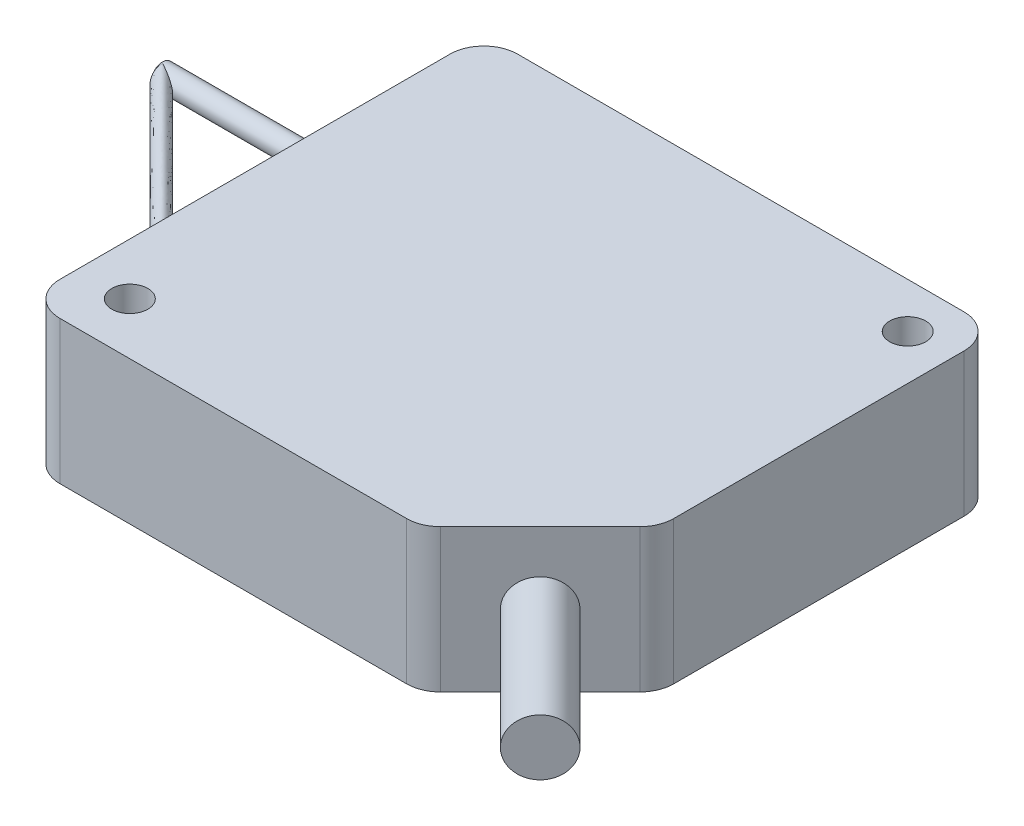
ISO-10303-21;
HEADER;
FILE_DESCRIPTION(('STEP AP214'),'2;1');
FILE_NAME('part.step','',(''),(''),'','','');
FILE_SCHEMA(('AUTOMOTIVE_DESIGN { 1 0 10303 214 1 1 1 1 }'));
ENDSEC;
DATA;
#1=APPLICATION_CONTEXT('core data for automotive mechanical design processes');
#2=APPLICATION_PROTOCOL_DEFINITION('international standard','automotive_design',2000,#1);
#3=PRODUCT_CONTEXT('',#1,'mechanical');
#4=PRODUCT('Part','Part','',(#3));
#5=PRODUCT_RELATED_PRODUCT_CATEGORY('part','',(#4));
#6=PRODUCT_DEFINITION_FORMATION('','',#4);
#7=PRODUCT_DEFINITION_CONTEXT('part definition',#1,'design');
#8=PRODUCT_DEFINITION('design','',#6,#7);
#9=PRODUCT_DEFINITION_SHAPE('','',#8);
#10=(LENGTH_UNIT() NAMED_UNIT(*) SI_UNIT(.MILLI.,.METRE.));
#11=(NAMED_UNIT(*) PLANE_ANGLE_UNIT() SI_UNIT($,.RADIAN.));
#12=(NAMED_UNIT(*) SI_UNIT($,.STERADIAN.) SOLID_ANGLE_UNIT());
#13=UNCERTAINTY_MEASURE_WITH_UNIT(LENGTH_MEASURE(1.E-05),#10,'distance_accuracy_value','');
#14=(GEOMETRIC_REPRESENTATION_CONTEXT(3) GLOBAL_UNCERTAINTY_ASSIGNED_CONTEXT((#13)) GLOBAL_UNIT_ASSIGNED_CONTEXT((#10,
#11,#12)) REPRESENTATION_CONTEXT('',''));
#15=CARTESIAN_POINT('',(0.,0.,0.));
#16=DIRECTION('',(0.,0.,1.));
#17=DIRECTION('',(1.,0.,0.));
#18=AXIS2_PLACEMENT_3D('',#15,#16,#17);
#19=CARTESIAN_POINT('',(1.,2.,-6.));
#20=DIRECTION('',(1.,0.,0.));
#21=DIRECTION('',(0.,0.,-1.));
#22=AXIS2_PLACEMENT_3D('',#19,#20,#21);
#23=PLANE('',#22);
#24=CARTESIAN_POINT('',(1.,6.35,-29.6));
#25=DIRECTION('',(1.,0.,0.));
#26=DIRECTION('',(0.,0.,-1.));
#27=AXIS2_PLACEMENT_3D('',#24,#25,#26);
#28=CIRCLE('',#27,1.);
#29=CARTESIAN_POINT('',(1.,6.35,-30.6));
#30=VERTEX_POINT('',#29);
#31=EDGE_CURVE('E166',#30,#30,#28,.F.);
#32=ORIENTED_EDGE('',*,*,#31,.F.);
#33=EDGE_LOOP('',(#32));
#34=FACE_BOUND('',#33,.T.);
#35=DIRECTION('',(0.,0.,1.));
#36=VECTOR('',#35,1.);
#37=CARTESIAN_POINT('',(1.,2.,-34.6));
#38=LINE('',#37,#36);
#39=CARTESIAN_POINT('',(1.,2.,-32.6));
#40=VERTEX_POINT('',#39);
#41=CARTESIAN_POINT('',(1.,2.,-8.00000000000001));
#42=VERTEX_POINT('',#41);
#43=EDGE_CURVE('E195',#40,#42,#38,.T.);
#44=ORIENTED_EDGE('',*,*,#43,.T.);
#45=CARTESIAN_POINT('',(1.,4.,-8.));
#46=DIRECTION('',(1.,0.,0.));
#47=DIRECTION('',(0.,0.,-1.));
#48=AXIS2_PLACEMENT_3D('',#45,#46,#47);
#49=CIRCLE('',#48,2.);
#50=CARTESIAN_POINT('',(1.,4.,-6.));
#51=VERTEX_POINT('',#50);
#52=EDGE_CURVE('E274',#42,#51,#49,.F.);
#53=ORIENTED_EDGE('',*,*,#52,.T.);
#54=DIRECTION('',(0.,1.,0.));
#55=VECTOR('',#54,1.);
#56=CARTESIAN_POINT('',(1.,10.7,-6.));
#57=LINE('',#56,#55);
#58=CARTESIAN_POINT('',(1.,8.7,-6.));
#59=VERTEX_POINT('',#58);
#60=EDGE_CURVE('E198',#51,#59,#57,.T.);
#61=ORIENTED_EDGE('',*,*,#60,.T.);
#62=CARTESIAN_POINT('',(1.,8.7,-8.));
#63=DIRECTION('',(1.,0.,0.));
#64=DIRECTION('',(0.,0.,-1.));
#65=AXIS2_PLACEMENT_3D('',#62,#63,#64);
#66=CIRCLE('',#65,2.);
#67=CARTESIAN_POINT('',(1.,10.7,-8.00000000000001));
#68=VERTEX_POINT('',#67);
#69=EDGE_CURVE('E272',#59,#68,#66,.F.);
#70=ORIENTED_EDGE('',*,*,#69,.T.);
#71=DIRECTION('',(0.,0.,-1.));
#72=VECTOR('',#71,1.);
#73=CARTESIAN_POINT('',(1.,10.7,-34.6));
#74=LINE('',#73,#72);
#75=CARTESIAN_POINT('',(1.,10.7,-32.6));
#76=VERTEX_POINT('',#75);
#77=EDGE_CURVE('E202',#68,#76,#74,.T.);
#78=ORIENTED_EDGE('',*,*,#77,.T.);
#79=CARTESIAN_POINT('',(1.,8.7,-32.6));
#80=DIRECTION('',(1.,0.,0.));
#81=DIRECTION('',(0.,0.,-1.));
#82=AXIS2_PLACEMENT_3D('',#79,#80,#81);
#83=CIRCLE('',#82,2.);
#84=CARTESIAN_POINT('',(1.,8.7,-34.6));
#85=VERTEX_POINT('',#84);
#86=EDGE_CURVE('E268',#76,#85,#83,.F.);
#87=ORIENTED_EDGE('',*,*,#86,.T.);
#88=DIRECTION('',(0.,-1.,0.));
#89=VECTOR('',#88,1.);
#90=CARTESIAN_POINT('',(1.,10.7,-34.6));
#91=LINE('',#90,#89);
#92=CARTESIAN_POINT('',(1.,4.,-34.6));
#93=VERTEX_POINT('',#92);
#94=EDGE_CURVE('E205',#85,#93,#91,.T.);
#95=ORIENTED_EDGE('',*,*,#94,.T.);
#96=CARTESIAN_POINT('',(1.,4.,-32.6));
#97=DIRECTION('',(1.,0.,0.));
#98=DIRECTION('',(0.,0.,-1.));
#99=AXIS2_PLACEMENT_3D('',#96,#97,#98);
#100=CIRCLE('',#99,2.);
#101=EDGE_CURVE('E270',#93,#40,#100,.F.);
#102=ORIENTED_EDGE('',*,*,#101,.T.);
#103=EDGE_LOOP('',(#44,#53,#61,#70,#78,#87,#95,#102));
#104=FACE_BOUND('',#103,.T.);
#105=CARTESIAN_POINT('',(0.999999999999997,6.35,-11.));
#106=DIRECTION('',(-1.,0.,0.));
#107=DIRECTION('',(0.,0.,1.));
#108=AXIS2_PLACEMENT_3D('',#105,#106,#107);
#109=CIRCLE('',#108,1.);
#110=CARTESIAN_POINT('',(0.999999999999997,6.35,-10.));
#111=VERTEX_POINT('',#110);
#112=EDGE_CURVE('E11',#111,#111,#109,.T.);
#113=ORIENTED_EDGE('',*,*,#112,.F.);
#114=EDGE_LOOP('',(#113));
#115=FACE_BOUND('',#114,.T.);
#116=ADVANCED_FACE('F31',(#34,#104,#115),#23,.F.);
#117=CARTESIAN_POINT('',(-17.5,6.35,-29.6));
#118=DIRECTION('',(1.,0.,0.));
#119=DIRECTION('',(0.,0.,-1.));
#120=AXIS2_PLACEMENT_3D('',#117,#118,#119);
#121=CYLINDRICAL_SURFACE('',#120,1.);
#122=ORIENTED_EDGE('',*,*,#31,.T.);
#123=EDGE_LOOP('',(#122));
#124=FACE_BOUND('',#123,.T.);
#125=CARTESIAN_POINT('',(-17.5,6.35,-29.6));
#126=DIRECTION('',(-1.,0.,0.));
#127=DIRECTION('',(0.,0.,1.));
#128=AXIS2_PLACEMENT_3D('',#125,#126,#127);
#129=CIRCLE('',#128,1.);
#130=CARTESIAN_POINT('',(-17.5,6.35,-28.6));
#131=VERTEX_POINT('',#130);
#132=EDGE_CURVE('E170',#131,#131,#129,.T.);
#133=ORIENTED_EDGE('',*,*,#132,.F.);
#134=EDGE_LOOP('',(#133));
#135=FACE_BOUND('',#134,.T.);
#136=CARTESIAN_POINT('',(-17.3847763108503,5.35580701525952,-29.4923881554251));
#137=CARTESIAN_POINT('',(-17.310243625098,5.35986745791576,-29.4551218125515));
#138=CARTESIAN_POINT('',(-17.2357842856062,5.36599286304666,-29.4178921428041));
#139=CARTESIAN_POINT('',(-17.0871803121188,5.38267367968977,-29.3435901560583));
#140=CARTESIAN_POINT('',(-17.0130361343693,5.39323413995916,-29.3065180671828));
#141=CARTESIAN_POINT('',(-16.8653793529942,5.41908114270014,-29.2326896765034));
#142=CARTESIAN_POINT('',(-16.7918669483466,5.43436912181265,-29.1959334741885));
#143=CARTESIAN_POINT('',(-16.6458701853368,5.47019015357799,-29.1229350926532));
#144=CARTESIAN_POINT('',(-16.5733855542558,5.49072178625981,-29.0866927770735));
#145=CARTESIAN_POINT('',(-16.4551950691772,5.5295567658836,-29.0275975346238));
#146=CARTESIAN_POINT('',(-16.4090276997573,5.54610885492395,-29.0045138499885));
#147=CARTESIAN_POINT('',(-16.3175983635991,5.58207520713222,-28.9587991819042));
#148=CARTESIAN_POINT('',(-16.2723361196687,5.6014885783099,-28.9361680598591));
#149=CARTESIAN_POINT('',(-16.1941901970999,5.63834384285589,-28.8970950985313));
#150=CARTESIAN_POINT('',(-16.1610370480583,5.65506807802909,-28.8805185240228));
#151=CARTESIAN_POINT('',(-16.0955845028499,5.6906310600694,-28.8477922514312));
#152=CARTESIAN_POINT('',(-16.0632866524229,5.70947335018052,-28.831643326218));
#153=CARTESIAN_POINT('',(-15.9820058290998,5.76082370450563,-28.7910029145396));
#154=CARTESIAN_POINT('',(-15.933857032719,5.79505682710886,-28.7669285163223));
#155=CARTESIAN_POINT('',(-15.8652814683382,5.85183402254099,-28.7326407341876));
#156=CARTESIAN_POINT('',(-15.843052494921,5.87164051106554,-28.7215262475134));
#157=CARTESIAN_POINT('',(-15.8001827970631,5.91328779090199,-28.7000913985845));
#158=CARTESIAN_POINT('',(-15.7795435527532,5.93513043716419,-28.689771776395));
#159=CARTESIAN_POINT('',(-15.7182633068036,6.00709548994654,-28.6591316533626));
#160=CARTESIAN_POINT('',(-15.6811185184997,6.06148526774109,-28.6405592592434));
#161=CARTESIAN_POINT('',(-15.6413197710703,6.14616497512418,-28.6206598855378));
#162=CARTESIAN_POINT('',(-15.6311715206006,6.17206893131412,-28.6155857603011));
#163=CARTESIAN_POINT('',(-15.6148515753546,6.22541385293124,-28.6074257876765));
#164=CARTESIAN_POINT('',(-15.6086755260327,6.25285309928183,-28.6043377630158));
#165=CARTESIAN_POINT('',(-15.6009132546554,6.30874678210803,-28.6004566273282));
#166=CARTESIAN_POINT('',(-15.5993591153064,6.33720693317751,-28.5996795576543));
#167=CARTESIAN_POINT('',(-15.6011258833518,6.39393690287961,-28.6005629416747));
#168=CARTESIAN_POINT('',(-15.6044472105158,6.42220670491296,-28.6022236052536));
#169=CARTESIAN_POINT('',(-15.6149804837681,6.47469146088525,-28.6074902418878));
#170=CARTESIAN_POINT('',(-15.6217497821927,6.49902151061303,-28.6108748911098));
#171=CARTESIAN_POINT('',(-15.6383446123074,6.54635648354788,-28.6191723061676));
#172=CARTESIAN_POINT('',(-15.6481746853839,6.56935937709176,-28.6240873426965));
#173=CARTESIAN_POINT('',(-15.6771978614054,6.62765132246839,-28.6385989306953));
#174=CARTESIAN_POINT('',(-15.6984108274498,6.66167810955879,-28.6492054137229));
#175=CARTESIAN_POINT('',(-15.745245229897,6.72568648050616,-28.6726226149504));
#176=CARTESIAN_POINT('',(-15.7708784373862,6.75565687174442,-28.6854392186935));
#177=CARTESIAN_POINT('',(-15.821867216591,6.80860208538243,-28.7109336082951));
#178=CARTESIAN_POINT('',(-15.8468899979777,6.83198489588555,-28.7234449989891));
#179=CARTESIAN_POINT('',(-15.8985730867418,6.87625301124813,-28.7492865433706));
#180=CARTESIAN_POINT('',(-15.9252312018803,6.89714155363213,-28.7626156009386));
#181=CARTESIAN_POINT('',(-15.9954010142126,6.94812216011064,-28.7977005071085));
#182=CARTESIAN_POINT('',(-16.0398256769645,6.97663867014264,-28.8199128384932));
#183=CARTESIAN_POINT('',(-16.1307031349753,7.02933838757336,-28.8653515674766));
#184=CARTESIAN_POINT('',(-16.1771581392555,7.05351672131496,-28.8885790695858));
#185=CARTESIAN_POINT('',(-16.271276731196,7.09811076358632,-28.9356383656397));
#186=CARTESIAN_POINT('',(-16.31893523691,7.11854000327428,-28.9594676186107));
#187=CARTESIAN_POINT('',(-16.4152436264059,7.15623983273529,-29.007621813359));
#188=CARTESIAN_POINT('',(-16.4638937428288,7.17350967157932,-29.0319468714567));
#189=CARTESIAN_POINT('',(-16.5618518026218,7.20522627957335,-29.0809259012685));
#190=CARTESIAN_POINT('',(-16.6111588125432,7.21967667554942,-29.1055794062581));
#191=CARTESIAN_POINT('',(-16.7103220254289,7.24605021126928,-29.1551610127279));
#192=CARTESIAN_POINT('',(-16.7601784156319,7.25797245947007,-29.1800892078276));
#193=CARTESIAN_POINT('',(-16.9050275061144,7.28910635161141,-29.252513753035));
#194=CARTESIAN_POINT('',(-17.0005489251864,7.30531363833591,-29.3002744625133));
#195=CARTESIAN_POINT('',(-17.1443440968937,7.32401453553611,-29.3721720484867));
#196=CARTESIAN_POINT('',(-17.1923498513107,7.32931256898411,-29.3961749257694));
#197=CARTESIAN_POINT('',(-17.2884813840548,7.33809665960482,-29.4442406921958));
#198=CARTESIAN_POINT('',(-17.3366071274664,7.3415831933199,-29.4683035638817));
#199=CARTESIAN_POINT('',(-17.3847763108501,7.34419298474035,-29.4923881554254));
#200=B_SPLINE_CURVE_WITH_KNOTS('',3,(#136,#137,#138,#139,#140,#141,#142,#143,#144,#145,#146,
#147,#148,#149,#150,#151,#152,#153,#154,#155,#156,#157,#158,#159,#160,#161,#162,#163,#164,#165,
#166,#167,#168,#169,#170,#171,#172,#173,#174,#175,#176,#177,#178,#179,#180,#181,#182,#183,#184,
#185,#186,#187,#188,#189,#190,#191,#192,#193,#194,#195,#196,#197,#198,#199),.UNSPECIFIED.,.F.,
.F.,(4,2,2,2,2,2,2,2,2,2,2,2,2,2,2,2,2,2,2,2,2,2,2,2,2,2,2,2,2,2,2,4),(0.,0.250289149542454,
0.500863997711973,0.751515067774774,1.00209833386037,1.1646473598658,1.32714581879982,
1.44907870737169,1.57121869858094,1.76206440002198,1.85728585417112,1.95259491949081,
2.15468033805398,2.2392089546906,2.32364474774139,2.40866529434888,2.49369316151331,
2.56983917256255,2.64609870706466,2.76981409647456,2.89386417606205,3.0030919851586,
3.11217644042589,3.28369854706395,3.45541215723075,3.62649328024101,3.79761501327529,
3.96851514903835,4.13947545231302,4.46318144145814,4.62495751389052,4.7866910071089),.UNSPECIFIED.);
#201=CARTESIAN_POINT('',(-17.3847763108503,5.35580701525952,-29.4923881554251));
#202=VERTEX_POINT('',#201);
#203=CARTESIAN_POINT('',(-17.3847763108503,7.34419298474048,-29.4923881554251));
#204=VERTEX_POINT('',#203);
#205=EDGE_CURVE('E39',#202,#204,#200,.T.);
#206=ORIENTED_EDGE('',*,*,#205,.F.);
#207=CARTESIAN_POINT('',(-17.3847763108503,6.35,-29.6));
#208=DIRECTION('',(-1.,0.,0.));
#209=DIRECTION('',(0.,0.,1.));
#210=AXIS2_PLACEMENT_3D('',#207,#208,#209);
#211=CIRCLE('',#210,1.);
#212=EDGE_CURVE('E162',#202,#204,#211,.T.);
#213=ORIENTED_EDGE('',*,*,#212,.T.);
#214=EDGE_LOOP('',(#206,#213));
#215=FACE_BOUND('',#214,.T.);
#216=ADVANCED_FACE('F172',(#124,#135,#215),#121,.T.);
#217=CARTESIAN_POINT('',(45.6,12.7,-10.6));
#218=DIRECTION('',(-0.707106781186549,0.,-0.707106781186546));
#219=DIRECTION('',(-0.707106781186546,0.,0.707106781186549));
#220=AXIS2_PLACEMENT_3D('',#217,#218,#219);
#221=PLANE('',#220);
#222=DIRECTION('',(0.707106781186546,0.,-0.707106781186549));
#223=VECTOR('',#222,1.);
#224=CARTESIAN_POINT('',(45.6,12.7,-10.6));
#225=LINE('',#224,#223);
#226=CARTESIAN_POINT('',(35.8786796564404,12.7,-0.878679656440359));
#227=VERTEX_POINT('',#226);
#228=CARTESIAN_POINT('',(44.7213203435596,12.7,-9.72132034355968));
#229=VERTEX_POINT('',#228);
#230=EDGE_CURVE('E234',#227,#229,#225,.T.);
#231=ORIENTED_EDGE('',*,*,#230,.F.);
#232=DIRECTION('',(0.,-1.,0.));
#233=VECTOR('',#232,1.);
#234=CARTESIAN_POINT('',(35.8786796564404,12.7,-0.878679656440359));
#235=LINE('',#234,#233);
#236=CARTESIAN_POINT('',(35.8786796564404,0.,-0.878679656440359));
#237=VERTEX_POINT('',#236);
#238=EDGE_CURVE('E299',#227,#237,#235,.T.);
#239=ORIENTED_EDGE('',*,*,#238,.T.);
#240=DIRECTION('',(0.707106781186546,0.,-0.707106781186549));
#241=VECTOR('',#240,1.);
#242=CARTESIAN_POINT('',(45.6,0.,-10.6));
#243=LINE('',#242,#241);
#244=CARTESIAN_POINT('',(44.7213203435596,0.,-9.72132034355968));
#245=VERTEX_POINT('',#244);
#246=EDGE_CURVE('E249',#237,#245,#243,.T.);
#247=ORIENTED_EDGE('',*,*,#246,.T.);
#248=DIRECTION('',(0.,-1.,0.));
#249=VECTOR('',#248,1.);
#250=CARTESIAN_POINT('',(44.7213203435596,12.7,-9.72132034355968));
#251=LINE('',#250,#249);
#252=EDGE_CURVE('E297',#245,#229,#251,.F.);
#253=ORIENTED_EDGE('',*,*,#252,.T.);
#254=EDGE_LOOP('',(#231,#239,#247,#253));
#255=FACE_BOUND('',#254,.T.);
#256=CARTESIAN_POINT('',(40.3,6.35,-5.30000000000001));
#257=DIRECTION('',(-0.707106781186549,0.,-0.707106781186546));
#258=DIRECTION('',(-0.707106781186546,0.,0.707106781186549));
#259=AXIS2_PLACEMENT_3D('',#256,#257,#258);
#260=CIRCLE('',#259,2.5);
#261=CARTESIAN_POINT('',(38.5322330470336,6.35,-3.53223304703364));
#262=VERTEX_POINT('',#261);
#263=EDGE_CURVE('E294',#262,#262,#260,.F.);
#264=ORIENTED_EDGE('',*,*,#263,.F.);
#265=EDGE_LOOP('',(#264));
#266=FACE_BOUND('',#265,.T.);
#267=ADVANCED_FACE('F409',(#255,#266),#221,.F.);
#268=CARTESIAN_POINT('',(0.,12.7,0.));
#269=DIRECTION('',(0.,-1.,0.));
#270=DIRECTION('',(0.,0.,-1.));
#271=AXIS2_PLACEMENT_3D('',#268,#269,#270);
#272=PLANE('',#271);
#273=CARTESIAN_POINT('',(41.6,12.7,-36.6));
#274=DIRECTION('',(0.,1.,0.));
#275=DIRECTION('',(0.,0.,1.));
#276=AXIS2_PLACEMENT_3D('',#273,#274,#275);
#277=CIRCLE('',#276,1.6);
#278=CARTESIAN_POINT('',(41.6,12.7,-35.));
#279=VERTEX_POINT('',#278);
#280=EDGE_CURVE('E225',#279,#279,#277,.T.);
#281=ORIENTED_EDGE('',*,*,#280,.F.);
#282=EDGE_LOOP('',(#281));
#283=FACE_BOUND('',#282,.T.);
#284=DIRECTION('',(1.,0.,0.));
#285=VECTOR('',#284,1.);
#286=CARTESIAN_POINT('',(35.,12.7,0.));
#287=LINE('',#286,#285);
#288=CARTESIAN_POINT('',(3.,12.7,0.));
#289=VERTEX_POINT('',#288);
#290=CARTESIAN_POINT('',(33.7573593128807,12.7,0.));
#291=VERTEX_POINT('',#290);
#292=EDGE_CURVE('E231',#289,#291,#287,.T.);
#293=ORIENTED_EDGE('',*,*,#292,.T.);
#294=CARTESIAN_POINT('',(33.7573593128807,12.7,-3.));
#295=DIRECTION('',(0.,-1.,0.));
#296=DIRECTION('',(0.,0.,-1.));
#297=AXIS2_PLACEMENT_3D('',#294,#295,#296);
#298=CIRCLE('',#297,3.);
#299=EDGE_CURVE('E325',#291,#227,#298,.F.);
#300=ORIENTED_EDGE('',*,*,#299,.T.);
#301=ORIENTED_EDGE('',*,*,#230,.T.);
#302=CARTESIAN_POINT('',(42.6,12.7,-11.8426406871193));
#303=DIRECTION('',(0.,-1.,0.));
#304=DIRECTION('',(0.,0.,-1.));
#305=AXIS2_PLACEMENT_3D('',#302,#303,#304);
#306=CIRCLE('',#305,3.);
#307=CARTESIAN_POINT('',(45.6,12.7,-11.8426406871193));
#308=VERTEX_POINT('',#307);
#309=EDGE_CURVE('E323',#229,#308,#306,.F.);
#310=ORIENTED_EDGE('',*,*,#309,.T.);
#311=DIRECTION('',(0.,0.,-1.));
#312=VECTOR('',#311,1.);
#313=CARTESIAN_POINT('',(45.6,12.7,-40.6));
#314=LINE('',#313,#312);
#315=CARTESIAN_POINT('',(45.6,12.7,-37.6));
#316=VERTEX_POINT('',#315);
#317=EDGE_CURVE('E238',#308,#316,#314,.T.);
#318=ORIENTED_EDGE('',*,*,#317,.T.);
#319=CARTESIAN_POINT('',(42.6,12.7,-37.6));
#320=DIRECTION('',(0.,-1.,0.));
#321=DIRECTION('',(0.,0.,-1.));
#322=AXIS2_PLACEMENT_3D('',#319,#320,#321);
#323=CIRCLE('',#322,3.);
#324=CARTESIAN_POINT('',(42.6,12.7,-40.6));
#325=VERTEX_POINT('',#324);
#326=EDGE_CURVE('E321',#316,#325,#323,.F.);
#327=ORIENTED_EDGE('',*,*,#326,.T.);
#328=DIRECTION('',(-1.,0.,0.));
#329=VECTOR('',#328,1.);
#330=CARTESIAN_POINT('',(0.,12.7,-40.6));
#331=LINE('',#330,#329);
#332=CARTESIAN_POINT('',(3.,12.7,-40.6));
#333=VERTEX_POINT('',#332);
#334=EDGE_CURVE('E241',#325,#333,#331,.T.);
#335=ORIENTED_EDGE('',*,*,#334,.T.);
#336=CARTESIAN_POINT('',(3.,12.7,-37.6));
#337=DIRECTION('',(0.,-1.,0.));
#338=DIRECTION('',(0.,0.,-1.));
#339=AXIS2_PLACEMENT_3D('',#336,#337,#338);
#340=CIRCLE('',#339,3.);
#341=CARTESIAN_POINT('',(0.,12.7,-37.6));
#342=VERTEX_POINT('',#341);
#343=EDGE_CURVE('E319',#333,#342,#340,.F.);
#344=ORIENTED_EDGE('',*,*,#343,.T.);
#345=DIRECTION('',(0.,0.,1.));
#346=VECTOR('',#345,1.);
#347=CARTESIAN_POINT('',(0.,12.7,0.));
#348=LINE('',#347,#346);
#349=CARTESIAN_POINT('',(0.,12.7,-3.));
#350=VERTEX_POINT('',#349);
#351=EDGE_CURVE('E244',#342,#350,#348,.T.);
#352=ORIENTED_EDGE('',*,*,#351,.T.);
#353=CARTESIAN_POINT('',(3.,12.7,-3.));
#354=DIRECTION('',(0.,-1.,0.));
#355=DIRECTION('',(0.,0.,-1.));
#356=AXIS2_PLACEMENT_3D('',#353,#354,#355);
#357=CIRCLE('',#356,3.);
#358=EDGE_CURVE('E317',#350,#289,#357,.F.);
#359=ORIENTED_EDGE('',*,*,#358,.T.);
#360=EDGE_LOOP('',(#293,#300,#301,#310,#318,#327,#335,#344,#352,#359));
#361=FACE_BOUND('',#360,.T.);
#362=CARTESIAN_POINT('',(4.6,12.7,-4.60000000000001));
#363=DIRECTION('',(0.,1.,0.));
#364=DIRECTION('',(0.,0.,1.));
#365=AXIS2_PLACEMENT_3D('',#362,#363,#364);
#366=CIRCLE('',#365,1.6);
#367=CARTESIAN_POINT('',(4.6,12.7,-3.00000000000001));
#368=VERTEX_POINT('',#367);
#369=EDGE_CURVE('E219',#368,#368,#366,.T.);
#370=ORIENTED_EDGE('',*,*,#369,.F.);
#371=EDGE_LOOP('',(#370));
#372=FACE_BOUND('',#371,.T.);
#373=ADVANCED_FACE('F405',(#283,#361,#372),#272,.F.);
#374=CARTESIAN_POINT('',(0.,0.,0.));
#375=DIRECTION('',(0.,-1.,0.));
#376=DIRECTION('',(0.,0.,-1.));
#377=AXIS2_PLACEMENT_3D('',#374,#375,#376);
#378=PLANE('',#377);
#379=CARTESIAN_POINT('',(41.6,0.,-36.6));
#380=DIRECTION('',(0.,1.,0.));
#381=DIRECTION('',(0.,0.,1.));
#382=AXIS2_PLACEMENT_3D('',#379,#380,#381);
#383=CIRCLE('',#382,1.6);
#384=CARTESIAN_POINT('',(41.6,0.,-35.));
#385=VERTEX_POINT('',#384);
#386=EDGE_CURVE('E222',#385,#385,#383,.T.);
#387=ORIENTED_EDGE('',*,*,#386,.T.);
#388=EDGE_LOOP('',(#387));
#389=FACE_BOUND('',#388,.T.);
#390=ORIENTED_EDGE('',*,*,#246,.F.);
#391=CARTESIAN_POINT('',(33.7573593128807,0.,-3.));
#392=DIRECTION('',(0.,-1.,0.));
#393=DIRECTION('',(0.,0.,-1.));
#394=AXIS2_PLACEMENT_3D('',#391,#392,#393);
#395=CIRCLE('',#394,3.);
#396=CARTESIAN_POINT('',(33.7573593128807,0.,0.));
#397=VERTEX_POINT('',#396);
#398=EDGE_CURVE('E310',#237,#397,#395,.T.);
#399=ORIENTED_EDGE('',*,*,#398,.T.);
#400=DIRECTION('',(1.,0.,0.));
#401=VECTOR('',#400,1.);
#402=CARTESIAN_POINT('',(35.,0.,0.));
#403=LINE('',#402,#401);
#404=CARTESIAN_POINT('',(3.,0.,0.));
#405=VERTEX_POINT('',#404);
#406=EDGE_CURVE('E228',#405,#397,#403,.T.);
#407=ORIENTED_EDGE('',*,*,#406,.F.);
#408=CARTESIAN_POINT('',(3.,0.,-3.));
#409=DIRECTION('',(0.,-1.,0.));
#410=DIRECTION('',(0.,0.,-1.));
#411=AXIS2_PLACEMENT_3D('',#408,#409,#410);
#412=CIRCLE('',#411,3.);
#413=CARTESIAN_POINT('',(0.,0.,-3.));
#414=VERTEX_POINT('',#413);
#415=EDGE_CURVE('E302',#405,#414,#412,.T.);
#416=ORIENTED_EDGE('',*,*,#415,.T.);
#417=DIRECTION('',(0.,0.,1.));
#418=VECTOR('',#417,1.);
#419=CARTESIAN_POINT('',(0.,0.,0.));
#420=LINE('',#419,#418);
#421=CARTESIAN_POINT('',(0.,0.,-37.6));
#422=VERTEX_POINT('',#421);
#423=EDGE_CURVE('E235',#422,#414,#420,.T.);
#424=ORIENTED_EDGE('',*,*,#423,.F.);
#425=CARTESIAN_POINT('',(3.,0.,-37.6));
#426=DIRECTION('',(0.,-1.,0.));
#427=DIRECTION('',(0.,0.,-1.));
#428=AXIS2_PLACEMENT_3D('',#425,#426,#427);
#429=CIRCLE('',#428,3.);
#430=CARTESIAN_POINT('',(3.,0.,-40.6));
#431=VERTEX_POINT('',#430);
#432=EDGE_CURVE('E304',#422,#431,#429,.T.);
#433=ORIENTED_EDGE('',*,*,#432,.T.);
#434=DIRECTION('',(-1.,0.,0.));
#435=VECTOR('',#434,1.);
#436=CARTESIAN_POINT('',(0.,0.,-40.6));
#437=LINE('',#436,#435);
#438=CARTESIAN_POINT('',(42.6,0.,-40.6));
#439=VERTEX_POINT('',#438);
#440=EDGE_CURVE('E255',#439,#431,#437,.T.);
#441=ORIENTED_EDGE('',*,*,#440,.F.);
#442=CARTESIAN_POINT('',(42.6,0.,-37.6));
#443=DIRECTION('',(0.,-1.,0.));
#444=DIRECTION('',(0.,0.,-1.));
#445=AXIS2_PLACEMENT_3D('',#442,#443,#444);
#446=CIRCLE('',#445,3.);
#447=CARTESIAN_POINT('',(45.6,0.,-37.6));
#448=VERTEX_POINT('',#447);
#449=EDGE_CURVE('E306',#439,#448,#446,.T.);
#450=ORIENTED_EDGE('',*,*,#449,.T.);
#451=DIRECTION('',(0.,0.,-1.));
#452=VECTOR('',#451,1.);
#453=CARTESIAN_POINT('',(45.6,0.,-40.6));
#454=LINE('',#453,#452);
#455=CARTESIAN_POINT('',(45.6,0.,-11.8426406871193));
#456=VERTEX_POINT('',#455);
#457=EDGE_CURVE('E252',#456,#448,#454,.T.);
#458=ORIENTED_EDGE('',*,*,#457,.F.);
#459=CARTESIAN_POINT('',(42.6,0.,-11.8426406871193));
#460=DIRECTION('',(0.,-1.,0.));
#461=DIRECTION('',(0.,0.,-1.));
#462=AXIS2_PLACEMENT_3D('',#459,#460,#461);
#463=CIRCLE('',#462,3.);
#464=EDGE_CURVE('E308',#456,#245,#463,.T.);
#465=ORIENTED_EDGE('',*,*,#464,.T.);
#466=EDGE_LOOP('',(#390,#399,#407,#416,#424,#433,#441,#450,#458,#465));
#467=FACE_BOUND('',#466,.T.);
#468=CARTESIAN_POINT('',(4.6,0.,-4.60000000000001));
#469=DIRECTION('',(0.,1.,0.));
#470=DIRECTION('',(0.,0.,1.));
#471=AXIS2_PLACEMENT_3D('',#468,#469,#470);
#472=CIRCLE('',#471,1.6);
#473=CARTESIAN_POINT('',(4.6,0.,-3.00000000000001));
#474=VERTEX_POINT('',#473);
#475=EDGE_CURVE('E208',#474,#474,#472,.T.);
#476=ORIENTED_EDGE('',*,*,#475,.T.);
#477=EDGE_LOOP('',(#476));
#478=FACE_BOUND('',#477,.T.);
#479=ADVANCED_FACE('F408',(#389,#467,#478),#378,.T.);
#480=CARTESIAN_POINT('',(35.,12.7,0.));
#481=DIRECTION('',(0.,0.,-1.));
#482=DIRECTION('',(-1.,0.,0.));
#483=AXIS2_PLACEMENT_3D('',#480,#481,#482);
#484=PLANE('',#483);
#485=ORIENTED_EDGE('',*,*,#406,.T.);
#486=DIRECTION('',(0.,-1.,0.));
#487=VECTOR('',#486,1.);
#488=CARTESIAN_POINT('',(33.7573593128807,12.7,0.));
#489=LINE('',#488,#487);
#490=EDGE_CURVE('E315',#397,#291,#489,.F.);
#491=ORIENTED_EDGE('',*,*,#490,.T.);
#492=ORIENTED_EDGE('',*,*,#292,.F.);
#493=DIRECTION('',(0.,-1.,0.));
#494=VECTOR('',#493,1.);
#495=CARTESIAN_POINT('',(3.,12.7,0.));
#496=LINE('',#495,#494);
#497=EDGE_CURVE('E312',#289,#405,#496,.T.);
#498=ORIENTED_EDGE('',*,*,#497,.T.);
#499=EDGE_LOOP('',(#485,#491,#492,#498));
#500=FACE_BOUND('',#499,.T.);
#501=ADVANCED_FACE('F413',(#500),#484,.F.);
#502=CARTESIAN_POINT('',(45.6,12.7,-40.6));
#503=DIRECTION('',(-1.,0.,0.));
#504=DIRECTION('',(0.,0.,1.));
#505=AXIS2_PLACEMENT_3D('',#502,#503,#504);
#506=PLANE('',#505);
#507=ORIENTED_EDGE('',*,*,#317,.F.);
#508=DIRECTION('',(0.,-1.,0.));
#509=VECTOR('',#508,1.);
#510=CARTESIAN_POINT('',(45.6,12.7,-11.8426406871193));
#511=LINE('',#510,#509);
#512=EDGE_CURVE('E329',#308,#456,#511,.T.);
#513=ORIENTED_EDGE('',*,*,#512,.T.);
#514=ORIENTED_EDGE('',*,*,#457,.T.);
#515=DIRECTION('',(0.,-1.,0.));
#516=VECTOR('',#515,1.);
#517=CARTESIAN_POINT('',(45.6,12.7,-37.6));
#518=LINE('',#517,#516);
#519=EDGE_CURVE('E327',#448,#316,#518,.F.);
#520=ORIENTED_EDGE('',*,*,#519,.T.);
#521=EDGE_LOOP('',(#507,#513,#514,#520));
#522=FACE_BOUND('',#521,.T.);
#523=ADVANCED_FACE('F420',(#522),#506,.F.);
#524=CARTESIAN_POINT('',(0.,12.7,-40.6));
#525=DIRECTION('',(0.,0.,1.));
#526=DIRECTION('',(1.,0.,0.));
#527=AXIS2_PLACEMENT_3D('',#524,#525,#526);
#528=PLANE('',#527);
#529=ORIENTED_EDGE('',*,*,#334,.F.);
#530=DIRECTION('',(0.,-1.,0.));
#531=VECTOR('',#530,1.);
#532=CARTESIAN_POINT('',(42.6,12.7,-40.6));
#533=LINE('',#532,#531);
#534=EDGE_CURVE('E334',#325,#439,#533,.T.);
#535=ORIENTED_EDGE('',*,*,#534,.T.);
#536=ORIENTED_EDGE('',*,*,#440,.T.);
#537=DIRECTION('',(0.,-1.,0.));
#538=VECTOR('',#537,1.);
#539=CARTESIAN_POINT('',(3.,12.7,-40.6));
#540=LINE('',#539,#538);
#541=EDGE_CURVE('E332',#431,#333,#540,.F.);
#542=ORIENTED_EDGE('',*,*,#541,.T.);
#543=EDGE_LOOP('',(#529,#535,#536,#542));
#544=FACE_BOUND('',#543,.T.);
#545=ADVANCED_FACE('F417',(#544),#528,.F.);
#546=CARTESIAN_POINT('',(0.,12.7,0.));
#547=DIRECTION('',(1.,0.,0.));
#548=DIRECTION('',(0.,0.,-1.));
#549=AXIS2_PLACEMENT_3D('',#546,#547,#548);
#550=PLANE('',#549);
#551=DIRECTION('',(0.,1.,0.));
#552=VECTOR('',#551,1.);
#553=CARTESIAN_POINT('',(0.,10.7,-6.));
#554=LINE('',#553,#552);
#555=CARTESIAN_POINT('',(0.,4.,-6.));
#556=VERTEX_POINT('',#555);
#557=CARTESIAN_POINT('',(0.,8.7,-6.));
#558=VERTEX_POINT('',#557);
#559=EDGE_CURVE('E211',#556,#558,#554,.T.);
#560=ORIENTED_EDGE('',*,*,#559,.F.);
#561=CARTESIAN_POINT('',(0.,4.,-8.));
#562=DIRECTION('',(1.,0.,0.));
#563=DIRECTION('',(0.,0.,-1.));
#564=AXIS2_PLACEMENT_3D('',#561,#562,#563);
#565=CIRCLE('',#564,2.);
#566=CARTESIAN_POINT('',(0.,2.,-8.00000000000001));
#567=VERTEX_POINT('',#566);
#568=EDGE_CURVE('E286',#556,#567,#565,.T.);
#569=ORIENTED_EDGE('',*,*,#568,.T.);
#570=DIRECTION('',(0.,0.,1.));
#571=VECTOR('',#570,1.);
#572=CARTESIAN_POINT('',(0.,2.,-34.6));
#573=LINE('',#572,#571);
#574=CARTESIAN_POINT('',(0.,2.,-32.6));
#575=VERTEX_POINT('',#574);
#576=EDGE_CURVE('E194',#575,#567,#573,.T.);
#577=ORIENTED_EDGE('',*,*,#576,.F.);
#578=CARTESIAN_POINT('',(0.,4.,-32.6));
#579=DIRECTION('',(1.,0.,0.));
#580=DIRECTION('',(0.,0.,-1.));
#581=AXIS2_PLACEMENT_3D('',#578,#579,#580);
#582=CIRCLE('',#581,2.);
#583=CARTESIAN_POINT('',(0.,4.,-34.6));
#584=VERTEX_POINT('',#583);
#585=EDGE_CURVE('E290',#575,#584,#582,.T.);
#586=ORIENTED_EDGE('',*,*,#585,.T.);
#587=DIRECTION('',(0.,-1.,0.));
#588=VECTOR('',#587,1.);
#589=CARTESIAN_POINT('',(0.,10.7,-34.6));
#590=LINE('',#589,#588);
#591=CARTESIAN_POINT('',(0.,8.7,-34.6));
#592=VERTEX_POINT('',#591);
#593=EDGE_CURVE('E199',#592,#584,#590,.T.);
#594=ORIENTED_EDGE('',*,*,#593,.F.);
#595=CARTESIAN_POINT('',(0.,8.7,-32.6));
#596=DIRECTION('',(1.,0.,0.));
#597=DIRECTION('',(0.,0.,-1.));
#598=AXIS2_PLACEMENT_3D('',#595,#596,#597);
#599=CIRCLE('',#598,2.);
#600=CARTESIAN_POINT('',(0.,10.7,-32.6));
#601=VERTEX_POINT('',#600);
#602=EDGE_CURVE('E292',#592,#601,#599,.T.);
#603=ORIENTED_EDGE('',*,*,#602,.T.);
#604=DIRECTION('',(0.,0.,-1.));
#605=VECTOR('',#604,1.);
#606=CARTESIAN_POINT('',(0.,10.7,-34.6));
#607=LINE('',#606,#605);
#608=CARTESIAN_POINT('',(0.,10.7,-8.00000000000001));
#609=VERTEX_POINT('',#608);
#610=EDGE_CURVE('E214',#609,#601,#607,.T.);
#611=ORIENTED_EDGE('',*,*,#610,.F.);
#612=CARTESIAN_POINT('',(0.,8.7,-8.));
#613=DIRECTION('',(1.,0.,0.));
#614=DIRECTION('',(0.,0.,-1.));
#615=AXIS2_PLACEMENT_3D('',#612,#613,#614);
#616=CIRCLE('',#615,2.);
#617=EDGE_CURVE('E288',#609,#558,#616,.T.);
#618=ORIENTED_EDGE('',*,*,#617,.T.);
#619=EDGE_LOOP('',(#560,#569,#577,#586,#594,#603,#611,#618));
#620=FACE_BOUND('',#619,.T.);
#621=ORIENTED_EDGE('',*,*,#351,.F.);
#622=DIRECTION('',(0.,-1.,0.));
#623=VECTOR('',#622,1.);
#624=CARTESIAN_POINT('',(0.,12.7,-37.6));
#625=LINE('',#624,#623);
#626=EDGE_CURVE('E338',#342,#422,#625,.T.);
#627=ORIENTED_EDGE('',*,*,#626,.T.);
#628=ORIENTED_EDGE('',*,*,#423,.T.);
#629=DIRECTION('',(0.,-1.,0.));
#630=VECTOR('',#629,1.);
#631=CARTESIAN_POINT('',(0.,12.7,-3.));
#632=LINE('',#631,#630);
#633=EDGE_CURVE('E53',#414,#350,#632,.F.);
#634=ORIENTED_EDGE('',*,*,#633,.T.);
#635=EDGE_LOOP('',(#621,#627,#628,#634));
#636=FACE_BOUND('',#635,.T.);
#637=ADVANCED_FACE('F365',(#620,#636),#550,.F.);
#638=CARTESIAN_POINT('',(41.6,12.7,-36.6));
#639=DIRECTION('',(0.,-1.,0.));
#640=DIRECTION('',(0.,0.,-1.));
#641=AXIS2_PLACEMENT_3D('',#638,#639,#640);
#642=CYLINDRICAL_SURFACE('',#641,1.6);
#643=ORIENTED_EDGE('',*,*,#280,.T.);
#644=EDGE_LOOP('',(#643));
#645=FACE_BOUND('',#644,.T.);
#646=ORIENTED_EDGE('',*,*,#386,.F.);
#647=EDGE_LOOP('',(#646));
#648=FACE_BOUND('',#647,.T.);
#649=ADVANCED_FACE('F396',(#645,#648),#642,.F.);
#650=CARTESIAN_POINT('',(4.6,12.7,-4.60000000000001));
#651=DIRECTION('',(0.,-1.,0.));
#652=DIRECTION('',(0.,0.,-1.));
#653=AXIS2_PLACEMENT_3D('',#650,#651,#652);
#654=CYLINDRICAL_SURFACE('',#653,1.6);
#655=ORIENTED_EDGE('',*,*,#369,.T.);
#656=EDGE_LOOP('',(#655));
#657=FACE_BOUND('',#656,.T.);
#658=ORIENTED_EDGE('',*,*,#475,.F.);
#659=EDGE_LOOP('',(#658));
#660=FACE_BOUND('',#659,.T.);
#661=ADVANCED_FACE('F389',(#657,#660),#654,.F.);
#662=CARTESIAN_POINT('',(1.,2.,-34.6));
#663=DIRECTION('',(0.,-1.,0.));
#664=DIRECTION('',(0.,0.,-1.));
#665=AXIS2_PLACEMENT_3D('',#662,#663,#664);
#666=PLANE('',#665);
#667=ORIENTED_EDGE('',*,*,#576,.T.);
#668=DIRECTION('',(-1.,0.,0.));
#669=VECTOR('',#668,1.);
#670=CARTESIAN_POINT('',(1.,2.,-8.));
#671=LINE('',#670,#669);
#672=EDGE_CURVE('E266',#567,#42,#671,.F.);
#673=ORIENTED_EDGE('',*,*,#672,.T.);
#674=ORIENTED_EDGE('',*,*,#43,.F.);
#675=DIRECTION('',(-1.,0.,0.));
#676=VECTOR('',#675,1.);
#677=CARTESIAN_POINT('',(0.,2.,-32.6));
#678=LINE('',#677,#676);
#679=EDGE_CURVE('E263',#40,#575,#678,.T.);
#680=ORIENTED_EDGE('',*,*,#679,.T.);
#681=EDGE_LOOP('',(#667,#673,#674,#680));
#682=FACE_BOUND('',#681,.T.);
#683=ADVANCED_FACE('F387',(#682),#666,.F.);
#684=CARTESIAN_POINT('',(1.,10.7,-34.6));
#685=DIRECTION('',(0.,0.,-1.));
#686=DIRECTION('',(-1.,0.,0.));
#687=AXIS2_PLACEMENT_3D('',#684,#685,#686);
#688=PLANE('',#687);
#689=ORIENTED_EDGE('',*,*,#593,.T.);
#690=DIRECTION('',(-1.,0.,0.));
#691=VECTOR('',#690,1.);
#692=CARTESIAN_POINT('',(1.,4.,-34.6));
#693=LINE('',#692,#691);
#694=EDGE_CURVE('E284',#584,#93,#693,.F.);
#695=ORIENTED_EDGE('',*,*,#694,.T.);
#696=ORIENTED_EDGE('',*,*,#94,.F.);
#697=DIRECTION('',(-1.,0.,0.));
#698=VECTOR('',#697,1.);
#699=CARTESIAN_POINT('',(0.,8.7,-34.6));
#700=LINE('',#699,#698);
#701=EDGE_CURVE('E281',#85,#592,#700,.T.);
#702=ORIENTED_EDGE('',*,*,#701,.T.);
#703=EDGE_LOOP('',(#689,#695,#696,#702));
#704=FACE_BOUND('',#703,.T.);
#705=ADVANCED_FACE('F383',(#704),#688,.F.);
#706=CARTESIAN_POINT('',(1.,10.7,-34.6));
#707=DIRECTION('',(0.,1.,0.));
#708=DIRECTION('',(0.,0.,1.));
#709=AXIS2_PLACEMENT_3D('',#706,#707,#708);
#710=PLANE('',#709);
#711=ORIENTED_EDGE('',*,*,#77,.F.);
#712=DIRECTION('',(-1.,0.,0.));
#713=VECTOR('',#712,1.);
#714=CARTESIAN_POINT('',(0.,10.7,-8.));
#715=LINE('',#714,#713);
#716=EDGE_CURVE('E278',#68,#609,#715,.T.);
#717=ORIENTED_EDGE('',*,*,#716,.T.);
#718=ORIENTED_EDGE('',*,*,#610,.T.);
#719=DIRECTION('',(-1.,0.,0.));
#720=VECTOR('',#719,1.);
#721=CARTESIAN_POINT('',(1.,10.7,-32.6));
#722=LINE('',#721,#720);
#723=EDGE_CURVE('E276',#601,#76,#722,.F.);
#724=ORIENTED_EDGE('',*,*,#723,.T.);
#725=EDGE_LOOP('',(#711,#717,#718,#724));
#726=FACE_BOUND('',#725,.T.);
#727=ADVANCED_FACE('F374',(#726),#710,.F.);
#728=CARTESIAN_POINT('',(1.,10.7,-6.));
#729=DIRECTION('',(0.,0.,1.));
#730=DIRECTION('',(1.,0.,0.));
#731=AXIS2_PLACEMENT_3D('',#728,#729,#730);
#732=PLANE('',#731);
#733=ORIENTED_EDGE('',*,*,#60,.F.);
#734=DIRECTION('',(-1.,0.,0.));
#735=VECTOR('',#734,1.);
#736=CARTESIAN_POINT('',(0.,4.,-6.));
#737=LINE('',#736,#735);
#738=EDGE_CURVE('E260',#51,#556,#737,.T.);
#739=ORIENTED_EDGE('',*,*,#738,.T.);
#740=ORIENTED_EDGE('',*,*,#559,.T.);
#741=DIRECTION('',(-1.,0.,0.));
#742=VECTOR('',#741,1.);
#743=CARTESIAN_POINT('',(1.,8.7,-6.));
#744=LINE('',#743,#742);
#745=EDGE_CURVE('E246',#558,#59,#744,.F.);
#746=ORIENTED_EDGE('',*,*,#745,.T.);
#747=EDGE_LOOP('',(#733,#739,#740,#746));
#748=FACE_BOUND('',#747,.T.);
#749=ADVANCED_FACE('F362',(#748),#732,.F.);
#750=CARTESIAN_POINT('',(1.,4.,-8.));
#751=DIRECTION('',(1.,0.,0.));
#752=DIRECTION('',(0.,0.,-1.));
#753=AXIS2_PLACEMENT_3D('',#750,#751,#752);
#754=CYLINDRICAL_SURFACE('',#753,2.);
#755=ORIENTED_EDGE('',*,*,#52,.F.);
#756=ORIENTED_EDGE('',*,*,#672,.F.);
#757=ORIENTED_EDGE('',*,*,#568,.F.);
#758=ORIENTED_EDGE('',*,*,#738,.F.);
#759=EDGE_LOOP('',(#755,#756,#757,#758));
#760=FACE_BOUND('',#759,.T.);
#761=ADVANCED_FACE('F359',(#760),#754,.F.);
#762=CARTESIAN_POINT('',(1.,8.7,-8.));
#763=DIRECTION('',(1.,0.,0.));
#764=DIRECTION('',(0.,0.,-1.));
#765=AXIS2_PLACEMENT_3D('',#762,#763,#764);
#766=CYLINDRICAL_SURFACE('',#765,2.);
#767=ORIENTED_EDGE('',*,*,#69,.F.);
#768=ORIENTED_EDGE('',*,*,#745,.F.);
#769=ORIENTED_EDGE('',*,*,#617,.F.);
#770=ORIENTED_EDGE('',*,*,#716,.F.);
#771=EDGE_LOOP('',(#767,#768,#769,#770));
#772=FACE_BOUND('',#771,.T.);
#773=ADVANCED_FACE('F371',(#772),#766,.F.);
#774=CARTESIAN_POINT('',(1.,4.,-32.6));
#775=DIRECTION('',(1.,0.,0.));
#776=DIRECTION('',(0.,0.,-1.));
#777=AXIS2_PLACEMENT_3D('',#774,#775,#776);
#778=CYLINDRICAL_SURFACE('',#777,2.);
#779=ORIENTED_EDGE('',*,*,#101,.F.);
#780=ORIENTED_EDGE('',*,*,#694,.F.);
#781=ORIENTED_EDGE('',*,*,#585,.F.);
#782=ORIENTED_EDGE('',*,*,#679,.F.);
#783=EDGE_LOOP('',(#779,#780,#781,#782));
#784=FACE_BOUND('',#783,.T.);
#785=ADVANCED_FACE('F386',(#784),#778,.F.);
#786=CARTESIAN_POINT('',(1.,8.7,-32.6));
#787=DIRECTION('',(1.,0.,0.));
#788=DIRECTION('',(0.,0.,-1.));
#789=AXIS2_PLACEMENT_3D('',#786,#787,#788);
#790=CYLINDRICAL_SURFACE('',#789,2.);
#791=ORIENTED_EDGE('',*,*,#86,.F.);
#792=ORIENTED_EDGE('',*,*,#723,.F.);
#793=ORIENTED_EDGE('',*,*,#602,.F.);
#794=ORIENTED_EDGE('',*,*,#701,.F.);
#795=EDGE_LOOP('',(#791,#792,#793,#794));
#796=FACE_BOUND('',#795,.T.);
#797=ADVANCED_FACE('F380',(#796),#790,.F.);
#798=CARTESIAN_POINT('',(50.9066017177982,6.35,5.30660171779817));
#799=DIRECTION('',(-0.707106781186549,0.,-0.707106781186546));
#800=DIRECTION('',(-0.707106781186546,0.,0.707106781186549));
#801=AXIS2_PLACEMENT_3D('',#798,#799,#800);
#802=CYLINDRICAL_SURFACE('',#801,2.5);
#803=CARTESIAN_POINT('',(50.9066017177982,6.35,5.30660171779817));
#804=DIRECTION('',(0.707106781186549,0.,0.707106781186546));
#805=DIRECTION('',(0.707106781186546,0.,-0.707106781186549));
#806=AXIS2_PLACEMENT_3D('',#803,#804,#805);
#807=CIRCLE('',#806,2.5);
#808=CARTESIAN_POINT('',(52.6743686707646,6.35,3.53883476483179));
#809=VERTEX_POINT('',#808);
#810=EDGE_CURVE('E191',#809,#809,#807,.T.);
#811=ORIENTED_EDGE('',*,*,#810,.F.);
#812=EDGE_LOOP('',(#811));
#813=FACE_BOUND('',#812,.T.);
#814=ORIENTED_EDGE('',*,*,#263,.T.);
#815=EDGE_LOOP('',(#814));
#816=FACE_BOUND('',#815,.T.);
#817=ADVANCED_FACE('F439',(#813,#816),#802,.T.);
#818=CARTESIAN_POINT('',(50.9066017177982,6.35,5.30660171779817));
#819=DIRECTION('',(0.707106781186549,0.,0.707106781186546));
#820=DIRECTION('',(0.707106781186546,0.,-0.707106781186549));
#821=AXIS2_PLACEMENT_3D('',#818,#819,#820);
#822=PLANE('',#821);
#823=ORIENTED_EDGE('',*,*,#810,.T.);
#824=EDGE_LOOP('',(#823));
#825=FACE_BOUND('',#824,.T.);
#826=ADVANCED_FACE('F444',(#825),#822,.T.);
#827=CARTESIAN_POINT('',(33.7573593128807,12.7,-3.));
#828=DIRECTION('',(0.,-1.,0.));
#829=DIRECTION('',(0.,0.,-1.));
#830=AXIS2_PLACEMENT_3D('',#827,#828,#829);
#831=CYLINDRICAL_SURFACE('',#830,3.);
#832=ORIENTED_EDGE('',*,*,#299,.F.);
#833=ORIENTED_EDGE('',*,*,#490,.F.);
#834=ORIENTED_EDGE('',*,*,#398,.F.);
#835=ORIENTED_EDGE('',*,*,#238,.F.);
#836=EDGE_LOOP('',(#832,#833,#834,#835));
#837=FACE_BOUND('',#836,.T.);
#838=ADVANCED_FACE('F440',(#837),#831,.T.);
#839=CARTESIAN_POINT('',(42.6,12.7,-11.8426406871193));
#840=DIRECTION('',(0.,-1.,0.));
#841=DIRECTION('',(0.,0.,-1.));
#842=AXIS2_PLACEMENT_3D('',#839,#840,#841);
#843=CYLINDRICAL_SURFACE('',#842,3.);
#844=ORIENTED_EDGE('',*,*,#309,.F.);
#845=ORIENTED_EDGE('',*,*,#252,.F.);
#846=ORIENTED_EDGE('',*,*,#464,.F.);
#847=ORIENTED_EDGE('',*,*,#512,.F.);
#848=EDGE_LOOP('',(#844,#845,#846,#847));
#849=FACE_BOUND('',#848,.T.);
#850=ADVANCED_FACE('F443',(#849),#843,.T.);
#851=CARTESIAN_POINT('',(42.6,12.7,-37.6));
#852=DIRECTION('',(0.,-1.,0.));
#853=DIRECTION('',(0.,0.,-1.));
#854=AXIS2_PLACEMENT_3D('',#851,#852,#853);
#855=CYLINDRICAL_SURFACE('',#854,3.);
#856=ORIENTED_EDGE('',*,*,#326,.F.);
#857=ORIENTED_EDGE('',*,*,#519,.F.);
#858=ORIENTED_EDGE('',*,*,#449,.F.);
#859=ORIENTED_EDGE('',*,*,#534,.F.);
#860=EDGE_LOOP('',(#856,#857,#858,#859));
#861=FACE_BOUND('',#860,.T.);
#862=ADVANCED_FACE('F448',(#861),#855,.T.);
#863=CARTESIAN_POINT('',(3.,12.7,-37.6));
#864=DIRECTION('',(0.,-1.,0.));
#865=DIRECTION('',(0.,0.,-1.));
#866=AXIS2_PLACEMENT_3D('',#863,#864,#865);
#867=CYLINDRICAL_SURFACE('',#866,3.);
#868=ORIENTED_EDGE('',*,*,#343,.F.);
#869=ORIENTED_EDGE('',*,*,#541,.F.);
#870=ORIENTED_EDGE('',*,*,#432,.F.);
#871=ORIENTED_EDGE('',*,*,#626,.F.);
#872=EDGE_LOOP('',(#868,#869,#870,#871));
#873=FACE_BOUND('',#872,.T.);
#874=ADVANCED_FACE('F451',(#873),#867,.T.);
#875=CARTESIAN_POINT('',(3.,12.7,-3.));
#876=DIRECTION('',(0.,-1.,0.));
#877=DIRECTION('',(0.,0.,-1.));
#878=AXIS2_PLACEMENT_3D('',#875,#876,#877);
#879=CYLINDRICAL_SURFACE('',#878,3.);
#880=ORIENTED_EDGE('',*,*,#358,.F.);
#881=ORIENTED_EDGE('',*,*,#633,.F.);
#882=ORIENTED_EDGE('',*,*,#415,.F.);
#883=ORIENTED_EDGE('',*,*,#497,.F.);
#884=EDGE_LOOP('',(#880,#881,#882,#883));
#885=FACE_BOUND('',#884,.T.);
#886=ADVANCED_FACE('F33',(#885),#879,.T.);
#887=CARTESIAN_POINT('',(-17.5,6.35,-29.6));
#888=DIRECTION('',(-1.,0.,0.));
#889=DIRECTION('',(0.,0.,1.));
#890=AXIS2_PLACEMENT_3D('',#887,#888,#889);
#891=PLANE('',#890);
#892=ORIENTED_EDGE('',*,*,#132,.T.);
#893=EDGE_LOOP('',(#892));
#894=FACE_BOUND('',#893,.T.);
#895=ADVANCED_FACE('F185',(#894),#891,.T.);
#896=CARTESIAN_POINT('',(-17.3847763108503,6.35,-29.3847763108502));
#897=DIRECTION('',(-1.,0.,0.));
#898=DIRECTION('',(0.,0.,1.));
#899=AXIS2_PLACEMENT_3D('',#896,#897,#898);
#900=CIRCLE('',#899,1.);
#901=DIRECTION('',(0.707106781186549,0.,0.707106781186546));
#902=VECTOR('',#901,1.);
#903=SURFACE_OF_LINEAR_EXTRUSION('',#900,#902);
#904=ORIENTED_EDGE('',*,*,#112,.T.);
#905=EDGE_LOOP('',(#904));
#906=FACE_BOUND('',#905,.T.);
#907=EDGE_CURVE('E45',#202,#204,#900,.T.);
#908=ORIENTED_EDGE('',*,*,#907,.F.);
#909=ORIENTED_EDGE('',*,*,#205,.T.);
#910=EDGE_LOOP('',(#908,#909));
#911=FACE_BOUND('',#910,.T.);
#912=ADVANCED_FACE('F169',(#906,#911),#903,.F.);
#913=CARTESIAN_POINT('',(-17.3847763108503,6.35,-29.3847763108502));
#914=DIRECTION('',(-1.,0.,0.));
#915=DIRECTION('',(0.,0.,1.));
#916=AXIS2_PLACEMENT_3D('',#913,#914,#915);
#917=PLANE('',#916);
#918=ORIENTED_EDGE('',*,*,#212,.F.);
#919=ORIENTED_EDGE('',*,*,#907,.T.);
#920=EDGE_LOOP('',(#918,#919));
#921=FACE_BOUND('',#920,.T.);
#922=ADVANCED_FACE('F163',(#921),#917,.T.);
#923=CLOSED_SHELL('',(#116,#216,#267,#373,#479,#501,#523,#545,#637,#649,#661,#683,#705,#727,
#749,#761,#773,#785,#797,#817,#826,#838,#850,#862,#874,#886,#895,#912,#922));
#924=MANIFOLD_SOLID_BREP('B2',#923);
#925=ADVANCED_BREP_SHAPE_REPRESENTATION('',(#18,#924),#14);
#926=SHAPE_DEFINITION_REPRESENTATION(#9,#925);
ENDSEC;
END-ISO-10303-21;
